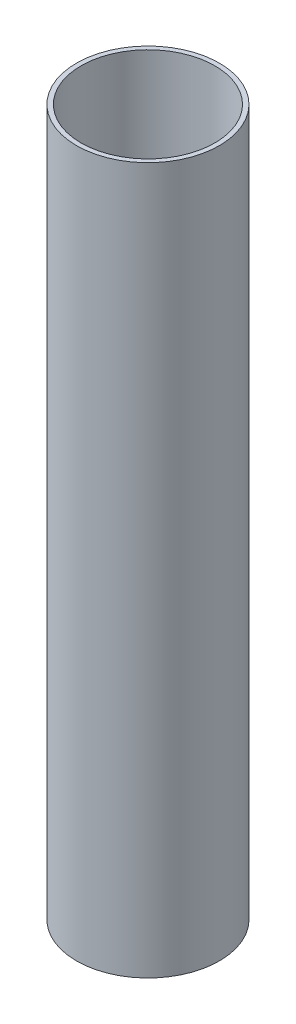
ISO-10303-21;
HEADER;
FILE_DESCRIPTION(('STEP AP214'),'2;1');
FILE_NAME('part.step','',(''),(''),'','','');
FILE_SCHEMA(('AUTOMOTIVE_DESIGN { 1 0 10303 214 1 1 1 1 }'));
ENDSEC;
DATA;
#1=APPLICATION_CONTEXT('core data for automotive mechanical design processes');
#2=APPLICATION_PROTOCOL_DEFINITION('international standard','automotive_design',2000,#1);
#3=PRODUCT_CONTEXT('',#1,'mechanical');
#4=PRODUCT('Part','Part','',(#3));
#5=PRODUCT_RELATED_PRODUCT_CATEGORY('part','',(#4));
#6=PRODUCT_DEFINITION_FORMATION('','',#4);
#7=PRODUCT_DEFINITION_CONTEXT('part definition',#1,'design');
#8=PRODUCT_DEFINITION('design','',#6,#7);
#9=PRODUCT_DEFINITION_SHAPE('','',#8);
#10=(LENGTH_UNIT() NAMED_UNIT(*) SI_UNIT(.MILLI.,.METRE.));
#11=(NAMED_UNIT(*) PLANE_ANGLE_UNIT() SI_UNIT($,.RADIAN.));
#12=(NAMED_UNIT(*) SI_UNIT($,.STERADIAN.) SOLID_ANGLE_UNIT());
#13=UNCERTAINTY_MEASURE_WITH_UNIT(LENGTH_MEASURE(1.E-05),#10,'distance_accuracy_value','');
#14=(GEOMETRIC_REPRESENTATION_CONTEXT(3) GLOBAL_UNCERTAINTY_ASSIGNED_CONTEXT((#13)) GLOBAL_UNIT_ASSIGNED_CONTEXT((#10,
#11,#12)) REPRESENTATION_CONTEXT('',''));
#15=CARTESIAN_POINT('',(0.,0.,0.));
#16=DIRECTION('',(0.,0.,1.));
#17=DIRECTION('',(1.,0.,0.));
#18=AXIS2_PLACEMENT_3D('',#15,#16,#17);
#19=CARTESIAN_POINT('',(0.,247.,0.));
#20=DIRECTION('',(0.,1.,0.));
#21=DIRECTION('',(0.,0.,1.));
#22=AXIS2_PLACEMENT_3D('',#19,#20,#21);
#23=PLANE('',#22);
#24=CARTESIAN_POINT('',(0.,247.,0.));
#25=DIRECTION('',(0.,1.,0.));
#26=DIRECTION('',(0.,0.,1.));
#27=AXIS2_PLACEMENT_3D('',#24,#25,#26);
#28=CIRCLE('',#27,25.);
#29=CARTESIAN_POINT('',(0.,247.,25.));
#30=VERTEX_POINT('',#29);
#31=EDGE_CURVE('E10',#30,#30,#28,.T.);
#32=ORIENTED_EDGE('',*,*,#31,.T.);
#33=EDGE_LOOP('',(#32));
#34=FACE_BOUND('',#33,.T.);
#35=CARTESIAN_POINT('',(0.,247.,0.));
#36=DIRECTION('',(0.,1.,0.));
#37=DIRECTION('',(0.,0.,1.));
#38=AXIS2_PLACEMENT_3D('',#35,#36,#37);
#39=CIRCLE('',#38,23.4);
#40=CARTESIAN_POINT('',(0.,247.,23.4));
#41=VERTEX_POINT('',#40);
#42=EDGE_CURVE('E49',#41,#41,#39,.T.);
#43=ORIENTED_EDGE('',*,*,#42,.F.);
#44=EDGE_LOOP('',(#43));
#45=FACE_BOUND('',#44,.T.);
#46=ADVANCED_FACE('F38',(#34,#45),#23,.T.);
#47=CARTESIAN_POINT('',(0.,0.,0.));
#48=DIRECTION('',(0.,1.,0.));
#49=DIRECTION('',(0.,0.,1.));
#50=AXIS2_PLACEMENT_3D('',#47,#48,#49);
#51=PLANE('',#50);
#52=CARTESIAN_POINT('',(0.,0.,0.));
#53=DIRECTION('',(0.,1.,0.));
#54=DIRECTION('',(0.,0.,1.));
#55=AXIS2_PLACEMENT_3D('',#52,#53,#54);
#56=CIRCLE('',#55,25.);
#57=CARTESIAN_POINT('',(0.,0.,25.));
#58=VERTEX_POINT('',#57);
#59=EDGE_CURVE('E42',#58,#58,#56,.T.);
#60=ORIENTED_EDGE('',*,*,#59,.F.);
#61=EDGE_LOOP('',(#60));
#62=FACE_BOUND('',#61,.T.);
#63=CARTESIAN_POINT('',(0.,0.,0.));
#64=DIRECTION('',(0.,1.,0.));
#65=DIRECTION('',(0.,0.,1.));
#66=AXIS2_PLACEMENT_3D('',#63,#64,#65);
#67=CIRCLE('',#66,23.4);
#68=CARTESIAN_POINT('',(0.,0.,23.4));
#69=VERTEX_POINT('',#68);
#70=EDGE_CURVE('E51',#69,#69,#67,.T.);
#71=ORIENTED_EDGE('',*,*,#70,.T.);
#72=EDGE_LOOP('',(#71));
#73=FACE_BOUND('',#72,.T.);
#74=ADVANCED_FACE('F61',(#62,#73),#51,.F.);
#75=CARTESIAN_POINT('',(0.,247.,0.));
#76=DIRECTION('',(0.,-1.,0.));
#77=DIRECTION('',(0.,0.,-1.));
#78=AXIS2_PLACEMENT_3D('',#75,#76,#77);
#79=CYLINDRICAL_SURFACE('',#78,25.);
#80=ORIENTED_EDGE('',*,*,#31,.F.);
#81=EDGE_LOOP('',(#80));
#82=FACE_BOUND('',#81,.T.);
#83=ORIENTED_EDGE('',*,*,#59,.T.);
#84=EDGE_LOOP('',(#83));
#85=FACE_BOUND('',#84,.T.);
#86=ADVANCED_FACE('F40',(#82,#85),#79,.T.);
#87=CARTESIAN_POINT('',(0.,247.,0.));
#88=DIRECTION('',(0.,-1.,0.));
#89=DIRECTION('',(0.,0.,-1.));
#90=AXIS2_PLACEMENT_3D('',#87,#88,#89);
#91=CYLINDRICAL_SURFACE('',#90,23.4);
#92=ORIENTED_EDGE('',*,*,#42,.T.);
#93=EDGE_LOOP('',(#92));
#94=FACE_BOUND('',#93,.T.);
#95=ORIENTED_EDGE('',*,*,#70,.F.);
#96=EDGE_LOOP('',(#95));
#97=FACE_BOUND('',#96,.T.);
#98=ADVANCED_FACE('F57',(#94,#97),#91,.F.);
#99=CLOSED_SHELL('',(#46,#74,#86,#98));
#100=MANIFOLD_SOLID_BREP('B2',#99);
#101=ADVANCED_BREP_SHAPE_REPRESENTATION('',(#18,#100),#14);
#102=SHAPE_DEFINITION_REPRESENTATION(#9,#101);
ENDSEC;
END-ISO-10303-21;
